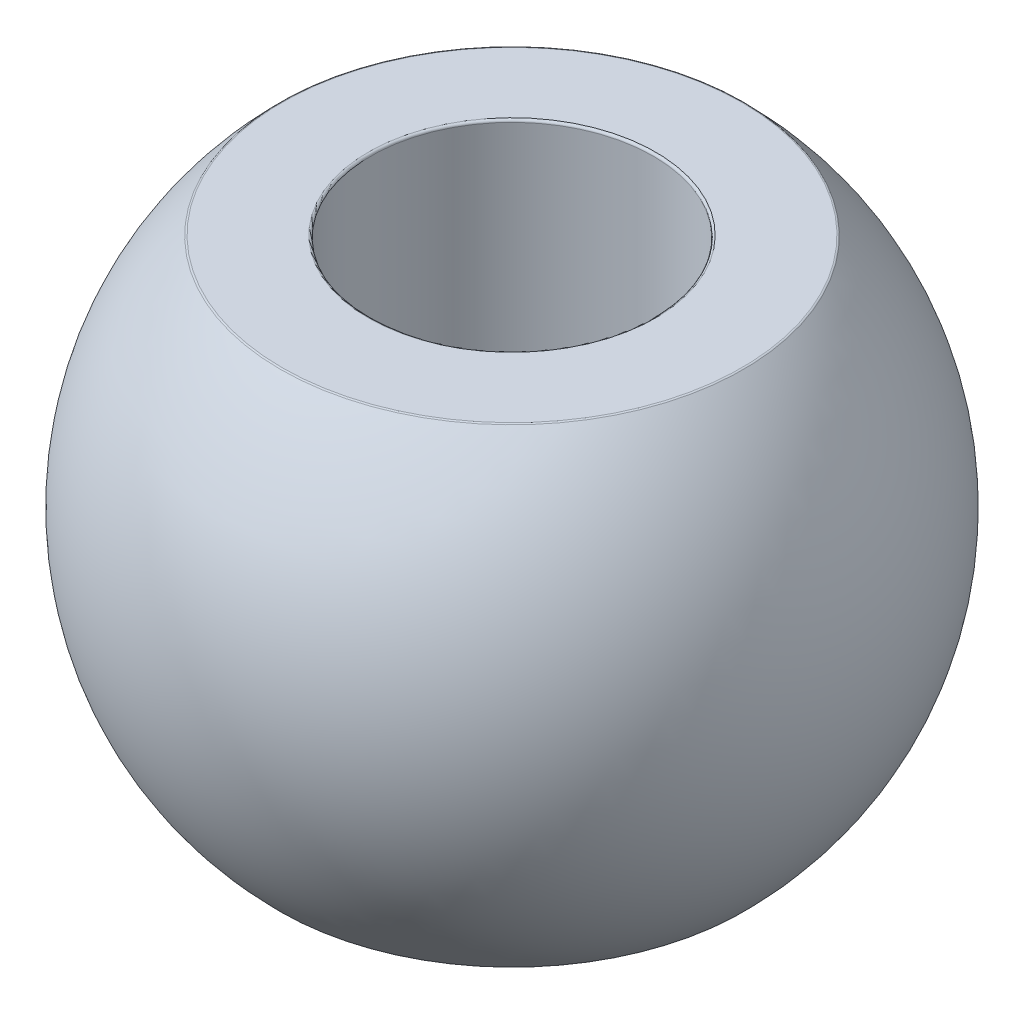
ISO-10303-21;
HEADER;
FILE_DESCRIPTION(('STEP AP214'),'2;1');
FILE_NAME('part.step','',(''),(''),'','','');
FILE_SCHEMA(('AUTOMOTIVE_DESIGN { 1 0 10303 214 1 1 1 1 }'));
ENDSEC;
DATA;
#1=APPLICATION_CONTEXT('core data for automotive mechanical design processes');
#2=APPLICATION_PROTOCOL_DEFINITION('international standard','automotive_design',2000,#1);
#3=PRODUCT_CONTEXT('',#1,'mechanical');
#4=PRODUCT('Part','Part','',(#3));
#5=PRODUCT_RELATED_PRODUCT_CATEGORY('part','',(#4));
#6=PRODUCT_DEFINITION_FORMATION('','',#4);
#7=PRODUCT_DEFINITION_CONTEXT('part definition',#1,'design');
#8=PRODUCT_DEFINITION('design','',#6,#7);
#9=PRODUCT_DEFINITION_SHAPE('','',#8);
#10=(LENGTH_UNIT() NAMED_UNIT(*) SI_UNIT(.MILLI.,.METRE.));
#11=(NAMED_UNIT(*) PLANE_ANGLE_UNIT() SI_UNIT($,.RADIAN.));
#12=(NAMED_UNIT(*) SI_UNIT($,.STERADIAN.) SOLID_ANGLE_UNIT());
#13=UNCERTAINTY_MEASURE_WITH_UNIT(LENGTH_MEASURE(1.E-05),#10,'distance_accuracy_value','');
#14=(GEOMETRIC_REPRESENTATION_CONTEXT(3) GLOBAL_UNCERTAINTY_ASSIGNED_CONTEXT((#13)) GLOBAL_UNIT_ASSIGNED_CONTEXT((#10,
#11,#12)) REPRESENTATION_CONTEXT('',''));
#15=CARTESIAN_POINT('',(0.,0.,0.));
#16=DIRECTION('',(0.,0.,1.));
#17=DIRECTION('',(1.,0.,0.));
#18=AXIS2_PLACEMENT_3D('',#15,#16,#17);
#19=CARTESIAN_POINT('',(6.,-10.,0.));
#20=DIRECTION('',(0.,-1.,0.));
#21=DIRECTION('',(0.,0.,-1.));
#22=AXIS2_PLACEMENT_3D('',#19,#20,#21);
#23=PLANE('',#22);
#24=CARTESIAN_POINT('',(0.,-10.,0.));
#25=DIRECTION('',(0.,-1.,0.));
#26=DIRECTION('',(0.,0.,-1.));
#27=AXIS2_PLACEMENT_3D('',#24,#25,#26);
#28=CIRCLE('',#27,9.75704873412037);
#29=CARTESIAN_POINT('',(0.,-10.,-9.75704873412037));
#30=VERTEX_POINT('',#29);
#31=EDGE_CURVE('E56',#30,#30,#28,.T.);
#32=ORIENTED_EDGE('',*,*,#31,.T.);
#33=EDGE_LOOP('',(#32));
#34=FACE_BOUND('',#33,.T.);
#35=CARTESIAN_POINT('',(0.,-10.,0.));
#36=DIRECTION('',(0.,-1.,0.));
#37=DIRECTION('',(0.,0.,-1.));
#38=AXIS2_PLACEMENT_3D('',#35,#36,#37);
#39=CIRCLE('',#38,6.1);
#40=CARTESIAN_POINT('',(0.,-10.,-6.1));
#41=VERTEX_POINT('',#40);
#42=EDGE_CURVE('E59',#41,#41,#39,.F.);
#43=ORIENTED_EDGE('',*,*,#42,.T.);
#44=EDGE_LOOP('',(#43));
#45=FACE_BOUND('',#44,.T.);
#46=ADVANCED_FACE('F30',(#34,#45),#23,.T.);
#47=CARTESIAN_POINT('',(0.,0.,0.));
#48=DIRECTION('',(0.,-1.,0.));
#49=DIRECTION('',(0.,0.,-1.));
#50=AXIS2_PLACEMENT_3D('',#47,#48,#49);
#51=CYLINDRICAL_SURFACE('',#50,6.);
#52=CARTESIAN_POINT('',(0.,9.9,0.));
#53=DIRECTION('',(0.,1.,0.));
#54=DIRECTION('',(0.,0.,1.));
#55=AXIS2_PLACEMENT_3D('',#52,#53,#54);
#56=CIRCLE('',#55,6.);
#57=CARTESIAN_POINT('',(0.,9.9,6.));
#58=VERTEX_POINT('',#57);
#59=EDGE_CURVE('E10',#58,#58,#56,.T.);
#60=ORIENTED_EDGE('',*,*,#59,.T.);
#61=EDGE_LOOP('',(#60));
#62=FACE_BOUND('',#61,.T.);
#63=CARTESIAN_POINT('',(0.,-9.9,0.));
#64=DIRECTION('',(0.,-1.,0.));
#65=DIRECTION('',(0.,0.,-1.));
#66=AXIS2_PLACEMENT_3D('',#63,#64,#65);
#67=CIRCLE('',#66,6.);
#68=CARTESIAN_POINT('',(0.,-9.9,-6.));
#69=VERTEX_POINT('',#68);
#70=EDGE_CURVE('E37',#69,#69,#67,.T.);
#71=ORIENTED_EDGE('',*,*,#70,.T.);
#72=EDGE_LOOP('',(#71));
#73=FACE_BOUND('',#72,.T.);
#74=ADVANCED_FACE('F73',(#62,#73),#51,.F.);
#75=CARTESIAN_POINT('',(6.,10.,0.));
#76=DIRECTION('',(0.,1.,0.));
#77=DIRECTION('',(0.,0.,1.));
#78=AXIS2_PLACEMENT_3D('',#75,#76,#77);
#79=PLANE('',#78);
#80=CARTESIAN_POINT('',(0.,10.,0.));
#81=DIRECTION('',(0.,1.,0.));
#82=DIRECTION('',(0.,0.,1.));
#83=AXIS2_PLACEMENT_3D('',#80,#81,#82);
#84=CIRCLE('',#83,9.75704873412037);
#85=CARTESIAN_POINT('',(0.,10.,9.75704873412037));
#86=VERTEX_POINT('',#85);
#87=EDGE_CURVE('E41',#86,#86,#84,.T.);
#88=ORIENTED_EDGE('',*,*,#87,.T.);
#89=EDGE_LOOP('',(#88));
#90=FACE_BOUND('',#89,.T.);
#91=CARTESIAN_POINT('',(0.,10.,0.));
#92=DIRECTION('',(0.,1.,0.));
#93=DIRECTION('',(0.,0.,1.));
#94=AXIS2_PLACEMENT_3D('',#91,#92,#93);
#95=CIRCLE('',#94,6.1);
#96=CARTESIAN_POINT('',(0.,10.,6.1));
#97=VERTEX_POINT('',#96);
#98=EDGE_CURVE('E45',#97,#97,#95,.F.);
#99=ORIENTED_EDGE('',*,*,#98,.T.);
#100=EDGE_LOOP('',(#99));
#101=FACE_BOUND('',#100,.T.);
#102=ADVANCED_FACE('F79',(#90,#101),#79,.T.);
#103=CARTESIAN_POINT('',(0.,0.,0.));
#104=DIRECTION('',(0.,-1.,0.));
#105=DIRECTION('',(1.,0.,0.));
#106=AXIS2_PLACEMENT_3D('',#103,#104,#105);
#107=SPHERICAL_SURFACE('',#106,14.);
#108=CARTESIAN_POINT('',(0.,-9.97122302158274,0.));
#109=DIRECTION('',(0.,1.,0.));
#110=DIRECTION('',(0.,0.,1.));
#111=AXIS2_PLACEMENT_3D('',#108,#109,#110);
#112=CIRCLE('',#111,9.82724332932987);
#113=CARTESIAN_POINT('',(0.,-9.97122302158274,9.82724332932987));
#114=VERTEX_POINT('',#113);
#115=EDGE_CURVE('E50',#114,#114,#112,.T.);
#116=ORIENTED_EDGE('',*,*,#115,.T.);
#117=EDGE_LOOP('',(#116));
#118=FACE_BOUND('',#117,.T.);
#119=CARTESIAN_POINT('',(0.,9.97122302158274,0.));
#120=DIRECTION('',(0.,-1.,0.));
#121=DIRECTION('',(0.,0.,-1.));
#122=AXIS2_PLACEMENT_3D('',#119,#120,#121);
#123=CIRCLE('',#122,9.82724332932987);
#124=CARTESIAN_POINT('',(0.,9.97122302158274,-9.82724332932987));
#125=VERTEX_POINT('',#124);
#126=EDGE_CURVE('E53',#125,#125,#123,.T.);
#127=ORIENTED_EDGE('',*,*,#126,.T.);
#128=EDGE_LOOP('',(#127));
#129=FACE_BOUND('',#128,.T.);
#130=ADVANCED_FACE('F86',(#118,#129),#107,.T.);
#131=CARTESIAN_POINT('',(0.,-9.9,0.));
#132=DIRECTION('',(0.,-1.,0.));
#133=DIRECTION('',(0.,0.,-1.));
#134=AXIS2_PLACEMENT_3D('',#131,#132,#133);
#135=TOROIDAL_SURFACE('',#134,9.75704873412037,0.1);
#136=ORIENTED_EDGE('',*,*,#115,.F.);
#137=EDGE_LOOP('',(#136));
#138=FACE_BOUND('',#137,.T.);
#139=ORIENTED_EDGE('',*,*,#31,.F.);
#140=EDGE_LOOP('',(#139));
#141=FACE_BOUND('',#140,.T.);
#142=ADVANCED_FACE('F83',(#138,#141),#135,.T.);
#143=CARTESIAN_POINT('',(0.,9.9,0.));
#144=DIRECTION('',(0.,1.,0.));
#145=DIRECTION('',(0.,0.,1.));
#146=AXIS2_PLACEMENT_3D('',#143,#144,#145);
#147=TOROIDAL_SURFACE('',#146,9.75704873412037,0.1);
#148=ORIENTED_EDGE('',*,*,#87,.F.);
#149=EDGE_LOOP('',(#148));
#150=FACE_BOUND('',#149,.T.);
#151=ORIENTED_EDGE('',*,*,#126,.F.);
#152=EDGE_LOOP('',(#151));
#153=FACE_BOUND('',#152,.T.);
#154=ADVANCED_FACE('F70',(#150,#153),#147,.T.);
#155=CARTESIAN_POINT('',(0.,9.9,0.));
#156=DIRECTION('',(0.,1.,0.));
#157=DIRECTION('',(0.,0.,1.));
#158=AXIS2_PLACEMENT_3D('',#155,#156,#157);
#159=TOROIDAL_SURFACE('',#158,6.1,0.1);
#160=ORIENTED_EDGE('',*,*,#59,.F.);
#161=EDGE_LOOP('',(#160));
#162=FACE_BOUND('',#161,.T.);
#163=ORIENTED_EDGE('',*,*,#98,.F.);
#164=EDGE_LOOP('',(#163));
#165=FACE_BOUND('',#164,.T.);
#166=ADVANCED_FACE('F66',(#162,#165),#159,.T.);
#167=CARTESIAN_POINT('',(0.,-9.9,0.));
#168=DIRECTION('',(0.,-1.,0.));
#169=DIRECTION('',(0.,0.,-1.));
#170=AXIS2_PLACEMENT_3D('',#167,#168,#169);
#171=TOROIDAL_SURFACE('',#170,6.1,0.1);
#172=ORIENTED_EDGE('',*,*,#42,.F.);
#173=EDGE_LOOP('',(#172));
#174=FACE_BOUND('',#173,.T.);
#175=ORIENTED_EDGE('',*,*,#70,.F.);
#176=EDGE_LOOP('',(#175));
#177=FACE_BOUND('',#176,.T.);
#178=ADVANCED_FACE('F32',(#174,#177),#171,.T.);
#179=CLOSED_SHELL('',(#46,#74,#102,#130,#142,#154,#166,#178));
#180=MANIFOLD_SOLID_BREP('B2',#179);
#181=ADVANCED_BREP_SHAPE_REPRESENTATION('',(#18,#180),#14);
#182=SHAPE_DEFINITION_REPRESENTATION(#9,#181);
ENDSEC;
END-ISO-10303-21;
